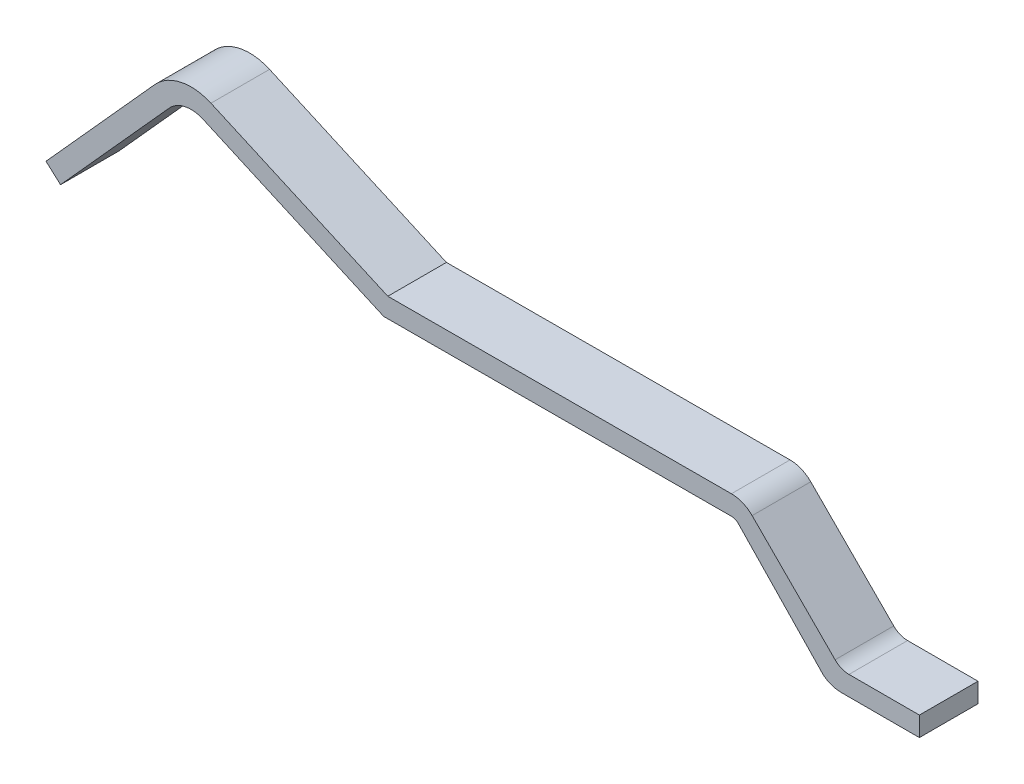
ISO-10303-21;
HEADER;
FILE_DESCRIPTION(('STEP AP214'),'2;1');
FILE_NAME('part.step','',(''),(''),'','','');
FILE_SCHEMA(('AUTOMOTIVE_DESIGN { 1 0 10303 214 1 1 1 1 }'));
ENDSEC;
DATA;
#1=APPLICATION_CONTEXT('core data for automotive mechanical design processes');
#2=APPLICATION_PROTOCOL_DEFINITION('international standard','automotive_design',2000,#1);
#3=PRODUCT_CONTEXT('',#1,'mechanical');
#4=PRODUCT('Part','Part','',(#3));
#5=PRODUCT_RELATED_PRODUCT_CATEGORY('part','',(#4));
#6=PRODUCT_DEFINITION_FORMATION('','',#4);
#7=PRODUCT_DEFINITION_CONTEXT('part definition',#1,'design');
#8=PRODUCT_DEFINITION('design','',#6,#7);
#9=PRODUCT_DEFINITION_SHAPE('','',#8);
#10=(LENGTH_UNIT() NAMED_UNIT(*) SI_UNIT(.MILLI.,.METRE.));
#11=(NAMED_UNIT(*) PLANE_ANGLE_UNIT() SI_UNIT($,.RADIAN.));
#12=(NAMED_UNIT(*) SI_UNIT($,.STERADIAN.) SOLID_ANGLE_UNIT());
#13=UNCERTAINTY_MEASURE_WITH_UNIT(LENGTH_MEASURE(1.E-05),#10,'distance_accuracy_value','');
#14=(GEOMETRIC_REPRESENTATION_CONTEXT(3) GLOBAL_UNCERTAINTY_ASSIGNED_CONTEXT((#13)) GLOBAL_UNIT_ASSIGNED_CONTEXT((#10,
#11,#12)) REPRESENTATION_CONTEXT('',''));
#15=CARTESIAN_POINT('',(0.,0.,0.));
#16=DIRECTION('',(0.,0.,1.));
#17=DIRECTION('',(1.,0.,0.));
#18=AXIS2_PLACEMENT_3D('',#15,#16,#17);
#19=CARTESIAN_POINT('',(17.1707476581065,0.197947805161229,0.3));
#20=DIRECTION('',(0.,-1.,0.));
#21=DIRECTION('',(1.,0.,0.));
#22=AXIS2_PLACEMENT_3D('',#19,#20,#21);
#23=PLANE('',#22);
#24=DIRECTION('',(-1.,0.,0.));
#25=VECTOR('',#24,1.);
#26=CARTESIAN_POINT('',(17.1707476581065,0.197947805161229,-0.3));
#27=LINE('',#26,#25);
#28=CARTESIAN_POINT('',(17.8917527563786,0.197947805161229,-0.3));
#29=VERTEX_POINT('',#28);
#30=CARTESIAN_POINT('',(17.1707476581065,0.197947805161225,-0.3));
#31=VERTEX_POINT('',#30);
#32=EDGE_CURVE('E188',#29,#31,#27,.T.);
#33=ORIENTED_EDGE('',*,*,#32,.T.);
#34=DIRECTION('',(0.,0.,-1.));
#35=VECTOR('',#34,1.);
#36=CARTESIAN_POINT('',(17.1707476581065,0.197947805161225,0.3));
#37=LINE('',#36,#35);
#38=CARTESIAN_POINT('',(17.1707476581065,0.197947805161225,0.3));
#39=VERTEX_POINT('',#38);
#40=EDGE_CURVE('E11',#39,#31,#37,.T.);
#41=ORIENTED_EDGE('',*,*,#40,.F.);
#42=DIRECTION('',(-1.,0.,0.));
#43=VECTOR('',#42,1.);
#44=CARTESIAN_POINT('',(17.1707476581065,0.197947805161229,0.3));
#45=LINE('',#44,#43);
#46=CARTESIAN_POINT('',(17.8917527563786,0.197947805161229,0.3));
#47=VERTEX_POINT('',#46);
#48=EDGE_CURVE('E222',#47,#39,#45,.T.);
#49=ORIENTED_EDGE('',*,*,#48,.F.);
#50=DIRECTION('',(0.,0.,-1.));
#51=VECTOR('',#50,1.);
#52=CARTESIAN_POINT('',(17.8917527563786,0.197947805161229,0.3));
#53=LINE('',#52,#51);
#54=EDGE_CURVE('E184',#47,#29,#53,.T.);
#55=ORIENTED_EDGE('',*,*,#54,.T.);
#56=EDGE_LOOP('',(#33,#41,#49,#55));
#57=FACE_BOUND('',#56,.T.);
#58=ADVANCED_FACE('F32',(#57),#23,.F.);
#59=CARTESIAN_POINT('',(17.1707476581065,0.397947805161221,0.3));
#60=DIRECTION('',(0.,0.,-1.));
#61=DIRECTION('',(-1.,0.,0.));
#62=AXIS2_PLACEMENT_3D('',#59,#60,#61);
#63=CYLINDRICAL_SURFACE('',#62,0.199999999999996);
#64=CARTESIAN_POINT('',(17.1707476581065,0.397947805161221,-0.3));
#65=DIRECTION('',(0.,0.,-1.));
#66=DIRECTION('',(1.,0.,0.));
#67=AXIS2_PLACEMENT_3D('',#64,#65,#66);
#68=CIRCLE('',#67,0.199999999999996);
#69=CARTESIAN_POINT('',(17.0290071205478,0.256846352253875,-0.3));
#70=VERTEX_POINT('',#69);
#71=EDGE_CURVE('E191',#31,#70,#68,.T.);
#72=ORIENTED_EDGE('',*,*,#71,.T.);
#73=DIRECTION('',(0.,0.,-1.));
#74=VECTOR('',#73,1.);
#75=CARTESIAN_POINT('',(17.0290071205478,0.256846352253875,0.3));
#76=LINE('',#75,#74);
#77=CARTESIAN_POINT('',(17.0290071205478,0.256846352253875,0.3));
#78=VERTEX_POINT('',#77);
#79=EDGE_CURVE('E40',#78,#70,#76,.T.);
#80=ORIENTED_EDGE('',*,*,#79,.F.);
#81=CARTESIAN_POINT('',(17.1707476581065,0.397947805161221,0.3));
#82=DIRECTION('',(0.,0.,-1.));
#83=DIRECTION('',(1.,0.,0.));
#84=AXIS2_PLACEMENT_3D('',#81,#82,#83);
#85=CIRCLE('',#84,0.199999999999996);
#86=EDGE_CURVE('E121',#39,#78,#85,.T.);
#87=ORIENTED_EDGE('',*,*,#86,.F.);
#88=ORIENTED_EDGE('',*,*,#40,.T.);
#89=EDGE_LOOP('',(#72,#80,#87,#88));
#90=FACE_BOUND('',#89,.T.);
#91=ADVANCED_FACE('F330',(#90),#63,.F.);
#92=CARTESIAN_POINT('',(16.1796207220227,1.11007983951695,0.3));
#93=DIRECTION('',(-0.708702687793621,-0.705507264536728,0.));
#94=DIRECTION('',(0.705507264536728,-0.708702687793621,0.));
#95=AXIS2_PLACEMENT_3D('',#92,#93,#94);
#96=PLANE('',#95);
#97=DIRECTION('',(-0.705507264536728,0.708702687793621,0.));
#98=VECTOR('',#97,1.);
#99=CARTESIAN_POINT('',(16.1796207220227,1.11007983951695,-0.3));
#100=LINE('',#99,#98);
#101=CARTESIAN_POINT('',(16.1796207220227,1.11007983951695,-0.3));
#102=VERTEX_POINT('',#101);
#103=EDGE_CURVE('E193',#70,#102,#100,.T.);
#104=ORIENTED_EDGE('',*,*,#103,.T.);
#105=DIRECTION('',(0.,0.,-1.));
#106=VECTOR('',#105,1.);
#107=CARTESIAN_POINT('',(16.1796207220227,1.11007983951695,0.3));
#108=LINE('',#107,#106);
#109=CARTESIAN_POINT('',(16.1796207220227,1.11007983951695,0.3));
#110=VERTEX_POINT('',#109);
#111=EDGE_CURVE('E259',#110,#102,#108,.T.);
#112=ORIENTED_EDGE('',*,*,#111,.F.);
#113=DIRECTION('',(-0.705507264536728,0.708702687793621,0.));
#114=VECTOR('',#113,1.);
#115=CARTESIAN_POINT('',(16.1796207220227,1.11007983951695,0.3));
#116=LINE('',#115,#114);
#117=EDGE_CURVE('E267',#78,#110,#116,.T.);
#118=ORIENTED_EDGE('',*,*,#117,.F.);
#119=ORIENTED_EDGE('',*,*,#79,.T.);
#120=EDGE_LOOP('',(#104,#112,#118,#119));
#121=FACE_BOUND('',#120,.T.);
#122=ADVANCED_FACE('F265',(#121),#96,.F.);
#123=CARTESIAN_POINT('',(15.968162863443,0.899575409463471,0.3));
#124=DIRECTION('',(0.,0.,-1.));
#125=DIRECTION('',(-1.,0.,0.));
#126=AXIS2_PLACEMENT_3D('',#123,#124,#125);
#127=CYLINDRICAL_SURFACE('',#126,0.29837315735042);
#128=CARTESIAN_POINT('',(15.968162863443,0.899575409463471,-0.3));
#129=DIRECTION('',(0.,0.,1.));
#130=DIRECTION('',(1.,0.,0.));
#131=AXIS2_PLACEMENT_3D('',#128,#129,#130);
#132=CIRCLE('',#131,0.29837315735042);
#133=CARTESIAN_POINT('',(15.9674886876667,1.197947805161,-0.3));
#134=VERTEX_POINT('',#133);
#135=EDGE_CURVE('E195',#102,#134,#132,.T.);
#136=ORIENTED_EDGE('',*,*,#135,.T.);
#137=DIRECTION('',(0.,0.,-1.));
#138=VECTOR('',#137,1.);
#139=CARTESIAN_POINT('',(15.9674886876667,1.197947805161,0.3));
#140=LINE('',#139,#138);
#141=CARTESIAN_POINT('',(15.9674886876667,1.197947805161,0.3));
#142=VERTEX_POINT('',#141);
#143=EDGE_CURVE('E256',#142,#134,#140,.T.);
#144=ORIENTED_EDGE('',*,*,#143,.F.);
#145=CARTESIAN_POINT('',(15.968162863443,0.899575409463471,0.3));
#146=DIRECTION('',(0.,0.,1.));
#147=DIRECTION('',(1.,0.,0.));
#148=AXIS2_PLACEMENT_3D('',#145,#146,#147);
#149=CIRCLE('',#148,0.29837315735042);
#150=EDGE_CURVE('E285',#110,#142,#149,.T.);
#151=ORIENTED_EDGE('',*,*,#150,.F.);
#152=ORIENTED_EDGE('',*,*,#111,.T.);
#153=EDGE_LOOP('',(#136,#144,#151,#152));
#154=FACE_BOUND('',#153,.T.);
#155=ADVANCED_FACE('F276',(#154),#127,.T.);
#156=CARTESIAN_POINT('',(12.45,1.19000000000001,0.3));
#157=DIRECTION('',(0.00225950545359394,-0.999997447314294,0.));
#158=DIRECTION('',(0.999997447314295,0.00225950545359394,0.));
#159=AXIS2_PLACEMENT_3D('',#156,#157,#158);
#160=PLANE('',#159);
#161=DIRECTION('',(-0.999997447314295,-0.00225950545359394,0.));
#162=VECTOR('',#161,1.);
#163=CARTESIAN_POINT('',(12.45,1.19000000000001,-0.3));
#164=LINE('',#163,#162);
#165=CARTESIAN_POINT('',(12.45,1.19000000000001,-0.3));
#166=VERTEX_POINT('',#165);
#167=EDGE_CURVE('E197',#134,#166,#164,.T.);
#168=ORIENTED_EDGE('',*,*,#167,.T.);
#169=DIRECTION('',(0.,0.,-1.));
#170=VECTOR('',#169,1.);
#171=CARTESIAN_POINT('',(12.45,1.19000000000001,0.3));
#172=LINE('',#171,#170);
#173=CARTESIAN_POINT('',(12.45,1.19000000000001,0.3));
#174=VERTEX_POINT('',#173);
#175=EDGE_CURVE('E253',#174,#166,#172,.T.);
#176=ORIENTED_EDGE('',*,*,#175,.F.);
#177=DIRECTION('',(-0.999997447314295,-0.00225950545359394,0.));
#178=VECTOR('',#177,1.);
#179=CARTESIAN_POINT('',(12.45,1.19000000000001,0.3));
#180=LINE('',#179,#178);
#181=EDGE_CURVE('E282',#142,#174,#180,.T.);
#182=ORIENTED_EDGE('',*,*,#181,.F.);
#183=ORIENTED_EDGE('',*,*,#143,.T.);
#184=EDGE_LOOP('',(#168,#176,#182,#183));
#185=FACE_BOUND('',#184,.T.);
#186=ADVANCED_FACE('F280',(#185),#160,.F.);
#187=CARTESIAN_POINT('',(10.6393188810586,1.9961671740989,0.3));
#188=DIRECTION('',(-0.40673664307565,-0.913545457642667,0.));
#189=DIRECTION('',(0.913545457642668,-0.40673664307565,0.));
#190=AXIS2_PLACEMENT_3D('',#187,#188,#189);
#191=PLANE('',#190);
#192=DIRECTION('',(-0.913545457642668,0.40673664307565,0.));
#193=VECTOR('',#192,1.);
#194=CARTESIAN_POINT('',(10.6393188810586,1.9961671740989,-0.3));
#195=LINE('',#194,#193);
#196=CARTESIAN_POINT('',(10.6393188810586,1.9961671740989,-0.3));
#197=VERTEX_POINT('',#196);
#198=EDGE_CURVE('E199',#166,#197,#195,.T.);
#199=ORIENTED_EDGE('',*,*,#198,.T.);
#200=DIRECTION('',(0.,0.,-1.));
#201=VECTOR('',#200,1.);
#202=CARTESIAN_POINT('',(10.6393188810586,1.9961671740989,0.3));
#203=LINE('',#202,#201);
#204=CARTESIAN_POINT('',(10.6393188810586,1.9961671740989,0.3));
#205=VERTEX_POINT('',#204);
#206=EDGE_CURVE('E250',#205,#197,#203,.T.);
#207=ORIENTED_EDGE('',*,*,#206,.F.);
#208=DIRECTION('',(-0.913545457642668,0.40673664307565,0.));
#209=VECTOR('',#208,1.);
#210=CARTESIAN_POINT('',(10.6393188810586,1.9961671740989,0.3));
#211=LINE('',#210,#209);
#212=EDGE_CURVE('E284',#174,#205,#211,.T.);
#213=ORIENTED_EDGE('',*,*,#212,.F.);
#214=ORIENTED_EDGE('',*,*,#175,.T.);
#215=EDGE_LOOP('',(#199,#207,#213,#214));
#216=FACE_BOUND('',#215,.T.);
#217=ADVANCED_FACE('F343',(#216),#191,.F.);
#218=CARTESIAN_POINT('',(10.4359505595208,1.53939444527736,0.3));
#219=DIRECTION('',(0.,0.,-1.));
#220=DIRECTION('',(-1.,0.,0.));
#221=AXIS2_PLACEMENT_3D('',#218,#219,#220);
#222=CYLINDRICAL_SURFACE('',#221,0.50000000000019);
#223=CARTESIAN_POINT('',(10.4359505595208,1.53939444527736,-0.3));
#224=DIRECTION('',(0.,0.,1.));
#225=DIRECTION('',(1.,0.,0.));
#226=AXIS2_PLACEMENT_3D('',#223,#224,#225);
#227=CIRCLE('',#226,0.50000000000019);
#228=CARTESIAN_POINT('',(10.0643781467819,1.87395974845692,-0.3));
#229=VERTEX_POINT('',#228);
#230=EDGE_CURVE('E201',#197,#229,#227,.T.);
#231=ORIENTED_EDGE('',*,*,#230,.T.);
#232=DIRECTION('',(0.,0.,-1.));
#233=VECTOR('',#232,1.);
#234=CARTESIAN_POINT('',(10.0643781467819,1.87395974845692,0.3));
#235=LINE('',#234,#233);
#236=CARTESIAN_POINT('',(10.0643781467819,1.87395974845692,0.3));
#237=VERTEX_POINT('',#236);
#238=EDGE_CURVE('E247',#237,#229,#235,.T.);
#239=ORIENTED_EDGE('',*,*,#238,.F.);
#240=CARTESIAN_POINT('',(10.4359505595208,1.53939444527736,0.3));
#241=DIRECTION('',(0.,0.,1.));
#242=DIRECTION('',(1.,0.,0.));
#243=AXIS2_PLACEMENT_3D('',#240,#241,#242);
#244=CIRCLE('',#243,0.50000000000019);
#245=EDGE_CURVE('E287',#205,#237,#244,.T.);
#246=ORIENTED_EDGE('',*,*,#245,.F.);
#247=ORIENTED_EDGE('',*,*,#206,.T.);
#248=EDGE_LOOP('',(#231,#239,#246,#247));
#249=FACE_BOUND('',#248,.T.);
#250=ADVANCED_FACE('F346',(#249),#222,.T.);
#251=CARTESIAN_POINT('',(8.95090286046869,0.63732016052452,0.3));
#252=DIRECTION('',(0.743144825477361,-0.669130606358895,0.));
#253=DIRECTION('',(0.669130606358895,0.743144825477361,0.));
#254=AXIS2_PLACEMENT_3D('',#251,#252,#253);
#255=PLANE('',#254);
#256=DIRECTION('',(-0.669130606358895,-0.743144825477361,0.));
#257=VECTOR('',#256,1.);
#258=CARTESIAN_POINT('',(8.95090286046869,0.63732016052452,-0.3));
#259=LINE('',#258,#257);
#260=CARTESIAN_POINT('',(8.95090286046869,0.63732016052452,-0.3));
#261=VERTEX_POINT('',#260);
#262=EDGE_CURVE('E203',#229,#261,#259,.T.);
#263=ORIENTED_EDGE('',*,*,#262,.T.);
#264=DIRECTION('',(0.,0.,-1.));
#265=VECTOR('',#264,1.);
#266=CARTESIAN_POINT('',(8.95090286046869,0.63732016052452,0.3));
#267=LINE('',#266,#265);
#268=CARTESIAN_POINT('',(8.95090286046869,0.63732016052452,0.3));
#269=VERTEX_POINT('',#268);
#270=EDGE_CURVE('E244',#269,#261,#267,.T.);
#271=ORIENTED_EDGE('',*,*,#270,.F.);
#272=DIRECTION('',(-0.669130606358895,-0.743144825477361,0.));
#273=VECTOR('',#272,1.);
#274=CARTESIAN_POINT('',(8.95090286046869,0.63732016052452,0.3));
#275=LINE('',#274,#273);
#276=EDGE_CURVE('E293',#237,#269,#275,.T.);
#277=ORIENTED_EDGE('',*,*,#276,.F.);
#278=ORIENTED_EDGE('',*,*,#238,.T.);
#279=EDGE_LOOP('',(#263,#271,#277,#278));
#280=FACE_BOUND('',#279,.T.);
#281=ADVANCED_FACE('F350',(#280),#255,.F.);
#282=CARTESIAN_POINT('',(9.09953182556442,0.503494039252559,0.3));
#283=DIRECTION('',(0.669130606358746,0.743144825477495,0.));
#284=DIRECTION('',(-0.743144825477495,0.669130606358746,0.));
#285=AXIS2_PLACEMENT_3D('',#282,#283,#284);
#286=PLANE('',#285);
#287=DIRECTION('',(0.743144825477495,-0.669130606358746,0.));
#288=VECTOR('',#287,1.);
#289=CARTESIAN_POINT('',(9.09953182556442,0.503494039252559,-0.3));
#290=LINE('',#289,#288);
#291=CARTESIAN_POINT('',(9.09953182556442,0.503494039252559,-0.3));
#292=VERTEX_POINT('',#291);
#293=EDGE_CURVE('E205',#261,#292,#290,.T.);
#294=ORIENTED_EDGE('',*,*,#293,.T.);
#295=DIRECTION('',(0.,0.,-1.));
#296=VECTOR('',#295,1.);
#297=CARTESIAN_POINT('',(9.09953182556442,0.503494039252559,0.3));
#298=LINE('',#297,#296);
#299=CARTESIAN_POINT('',(9.09953182556442,0.503494039252559,0.3));
#300=VERTEX_POINT('',#299);
#301=EDGE_CURVE('E241',#300,#292,#298,.T.);
#302=ORIENTED_EDGE('',*,*,#301,.F.);
#303=DIRECTION('',(0.743144825477495,-0.669130606358746,0.));
#304=VECTOR('',#303,1.);
#305=CARTESIAN_POINT('',(9.09953182556442,0.503494039252559,0.3));
#306=LINE('',#305,#304);
#307=EDGE_CURVE('E295',#269,#300,#306,.T.);
#308=ORIENTED_EDGE('',*,*,#307,.F.);
#309=ORIENTED_EDGE('',*,*,#270,.T.);
#310=EDGE_LOOP('',(#294,#302,#308,#309));
#311=FACE_BOUND('',#310,.T.);
#312=ADVANCED_FACE('F354',(#311),#286,.F.);
#313=CARTESIAN_POINT('',(10.2130071118774,1.74013362718514,0.3));
#314=DIRECTION('',(-0.743144825477495,0.669130606358746,0.));
#315=DIRECTION('',(-0.669130606358746,-0.743144825477495,0.));
#316=AXIS2_PLACEMENT_3D('',#313,#314,#315);
#317=PLANE('',#316);
#318=DIRECTION('',(0.669130606358746,0.743144825477495,0.));
#319=VECTOR('',#318,1.);
#320=CARTESIAN_POINT('',(10.2130071118774,1.74013362718514,-0.3));
#321=LINE('',#320,#319);
#322=CARTESIAN_POINT('',(10.2130071118774,1.74013362718514,-0.3));
#323=VERTEX_POINT('',#322);
#324=EDGE_CURVE('E207',#292,#323,#321,.T.);
#325=ORIENTED_EDGE('',*,*,#324,.T.);
#326=DIRECTION('',(0.,0.,-1.));
#327=VECTOR('',#326,1.);
#328=CARTESIAN_POINT('',(10.2130071118774,1.74013362718514,0.3));
#329=LINE('',#328,#327);
#330=CARTESIAN_POINT('',(10.2130071118774,1.74013362718514,0.3));
#331=VERTEX_POINT('',#330);
#332=EDGE_CURVE('E238',#331,#323,#329,.T.);
#333=ORIENTED_EDGE('',*,*,#332,.F.);
#334=DIRECTION('',(0.669130606358746,0.743144825477495,0.));
#335=VECTOR('',#334,1.);
#336=CARTESIAN_POINT('',(10.2130071118774,1.74013362718514,0.3));
#337=LINE('',#336,#335);
#338=EDGE_CURVE('E297',#300,#331,#337,.T.);
#339=ORIENTED_EDGE('',*,*,#338,.F.);
#340=ORIENTED_EDGE('',*,*,#301,.T.);
#341=EDGE_LOOP('',(#325,#333,#339,#340));
#342=FACE_BOUND('',#341,.T.);
#343=ADVANCED_FACE('F358',(#342),#317,.F.);
#344=CARTESIAN_POINT('',(10.4359505595208,1.53939444527741,0.3));
#345=DIRECTION('',(0.,0.,-1.));
#346=DIRECTION('',(-1.,0.,0.));
#347=AXIS2_PLACEMENT_3D('',#344,#345,#346);
#348=CYLINDRICAL_SURFACE('',#347,0.300000000000162);
#349=CARTESIAN_POINT('',(10.4359505595208,1.53939444527741,-0.3));
#350=DIRECTION('',(0.,0.,-1.));
#351=DIRECTION('',(1.,0.,0.));
#352=AXIS2_PLACEMENT_3D('',#349,#350,#351);
#353=CIRCLE('',#352,0.300000000000162);
#354=CARTESIAN_POINT('',(10.5579715524435,1.81345808257036,-0.3));
#355=VERTEX_POINT('',#354);
#356=EDGE_CURVE('E209',#323,#355,#353,.T.);
#357=ORIENTED_EDGE('',*,*,#356,.T.);
#358=DIRECTION('',(0.,0.,-1.));
#359=VECTOR('',#358,1.);
#360=CARTESIAN_POINT('',(10.5579715524435,1.81345808257036,0.3));
#361=LINE('',#360,#359);
#362=CARTESIAN_POINT('',(10.5579715524435,1.81345808257036,0.3));
#363=VERTEX_POINT('',#362);
#364=EDGE_CURVE('E235',#363,#355,#361,.T.);
#365=ORIENTED_EDGE('',*,*,#364,.F.);
#366=CARTESIAN_POINT('',(10.4359505595208,1.53939444527741,0.3));
#367=DIRECTION('',(0.,0.,-1.));
#368=DIRECTION('',(1.,0.,0.));
#369=AXIS2_PLACEMENT_3D('',#366,#367,#368);
#370=CIRCLE('',#369,0.300000000000162);
#371=EDGE_CURVE('E299',#331,#363,#370,.T.);
#372=ORIENTED_EDGE('',*,*,#371,.F.);
#373=ORIENTED_EDGE('',*,*,#332,.T.);
#374=EDGE_LOOP('',(#357,#365,#372,#373));
#375=FACE_BOUND('',#374,.T.);
#376=ADVANCED_FACE('F362',(#375),#348,.F.);
#377=CARTESIAN_POINT('',(12.407488687666,0.99,0.3));
#378=DIRECTION('',(0.40673664307565,0.913545457642667,0.));
#379=DIRECTION('',(-0.913545457642668,0.40673664307565,0.));
#380=AXIS2_PLACEMENT_3D('',#377,#378,#379);
#381=PLANE('',#380);
#382=DIRECTION('',(0.913545457642668,-0.40673664307565,0.));
#383=VECTOR('',#382,1.);
#384=CARTESIAN_POINT('',(12.407488687666,0.99,-0.3));
#385=LINE('',#384,#383);
#386=CARTESIAN_POINT('',(12.407488687666,0.99,-0.3));
#387=VERTEX_POINT('',#386);
#388=EDGE_CURVE('E211',#355,#387,#385,.T.);
#389=ORIENTED_EDGE('',*,*,#388,.T.);
#390=DIRECTION('',(0.,0.,-1.));
#391=VECTOR('',#390,1.);
#392=CARTESIAN_POINT('',(12.407488687666,0.99,0.3));
#393=LINE('',#392,#391);
#394=CARTESIAN_POINT('',(12.407488687666,0.99,0.3));
#395=VERTEX_POINT('',#394);
#396=EDGE_CURVE('E232',#395,#387,#393,.T.);
#397=ORIENTED_EDGE('',*,*,#396,.F.);
#398=DIRECTION('',(0.913545457642668,-0.40673664307565,0.));
#399=VECTOR('',#398,1.);
#400=CARTESIAN_POINT('',(12.407488687666,0.99,0.3));
#401=LINE('',#400,#399);
#402=EDGE_CURVE('E301',#363,#395,#401,.T.);
#403=ORIENTED_EDGE('',*,*,#402,.F.);
#404=ORIENTED_EDGE('',*,*,#364,.T.);
#405=EDGE_LOOP('',(#389,#397,#403,#404));
#406=FACE_BOUND('',#405,.T.);
#407=ADVANCED_FACE('F366',(#406),#381,.F.);
#408=CARTESIAN_POINT('',(15.967488687666,0.998043859948213,0.3));
#409=DIRECTION('',(-0.00225950545358628,0.999997447314294,0.));
#410=DIRECTION('',(-0.999997447314295,-0.00225950545358628,0.));
#411=AXIS2_PLACEMENT_3D('',#408,#409,#410);
#412=PLANE('',#411);
#413=DIRECTION('',(0.999997447314295,0.00225950545358628,0.));
#414=VECTOR('',#413,1.);
#415=CARTESIAN_POINT('',(15.967488687666,0.998043859948213,-0.3));
#416=LINE('',#415,#414);
#417=CARTESIAN_POINT('',(15.967488687666,0.998043859948221,-0.3));
#418=VERTEX_POINT('',#417);
#419=EDGE_CURVE('E213',#387,#418,#416,.T.);
#420=ORIENTED_EDGE('',*,*,#419,.T.);
#421=DIRECTION('',(0.,0.,-1.));
#422=VECTOR('',#421,1.);
#423=CARTESIAN_POINT('',(15.967488687666,0.998043859948221,0.3));
#424=LINE('',#423,#422);
#425=CARTESIAN_POINT('',(15.967488687666,0.998043859948221,0.3));
#426=VERTEX_POINT('',#425);
#427=EDGE_CURVE('E229',#426,#418,#424,.T.);
#428=ORIENTED_EDGE('',*,*,#427,.F.);
#429=DIRECTION('',(0.999997447314295,0.00225950545358628,0.));
#430=VECTOR('',#429,1.);
#431=CARTESIAN_POINT('',(15.967488687666,0.998043859948213,0.3));
#432=LINE('',#431,#430);
#433=EDGE_CURVE('E303',#395,#426,#432,.T.);
#434=ORIENTED_EDGE('',*,*,#433,.F.);
#435=ORIENTED_EDGE('',*,*,#396,.T.);
#436=EDGE_LOOP('',(#420,#428,#434,#435));
#437=FACE_BOUND('',#436,.T.);
#438=ADVANCED_FACE('F370',(#437),#412,.F.);
#439=CARTESIAN_POINT('',(15.9677134245142,0.898581265536285,0.3));
#440=DIRECTION('',(0.,0.,-1.));
#441=DIRECTION('',(-1.,0.,0.));
#442=AXIS2_PLACEMENT_3D('',#439,#440,#441);
#443=CYLINDRICAL_SURFACE('',#442,0.0994628483093272);
#444=CARTESIAN_POINT('',(15.9677134245142,0.898581265536285,-0.3));
#445=DIRECTION('',(0.,0.,-1.));
#446=DIRECTION('',(-1.,0.,0.));
#447=AXIS2_PLACEMENT_3D('',#444,#445,#446);
#448=CIRCLE('',#447,0.0994628483093272);
#449=CARTESIAN_POINT('',(16.0381993657854,0.968756690557605,-0.3));
#450=VERTEX_POINT('',#449);
#451=EDGE_CURVE('E215',#418,#450,#448,.T.);
#452=ORIENTED_EDGE('',*,*,#451,.T.);
#453=DIRECTION('',(0.,0.,-1.));
#454=VECTOR('',#453,1.);
#455=CARTESIAN_POINT('',(16.0381993657854,0.968756690557605,0.3));
#456=LINE('',#455,#454);
#457=CARTESIAN_POINT('',(16.0381993657854,0.968756690557605,0.3));
#458=VERTEX_POINT('',#457);
#459=EDGE_CURVE('E226',#458,#450,#456,.T.);
#460=ORIENTED_EDGE('',*,*,#459,.F.);
#461=CARTESIAN_POINT('',(15.9677134245142,0.898581265536285,0.3));
#462=DIRECTION('',(0.,0.,-1.));
#463=DIRECTION('',(-1.,0.,0.));
#464=AXIS2_PLACEMENT_3D('',#461,#462,#463);
#465=CIRCLE('',#464,0.0994628483093272);
#466=EDGE_CURVE('E305',#426,#458,#465,.T.);
#467=ORIENTED_EDGE('',*,*,#466,.F.);
#468=ORIENTED_EDGE('',*,*,#427,.T.);
#469=EDGE_LOOP('',(#452,#460,#467,#468));
#470=FACE_BOUND('',#469,.T.);
#471=ADVANCED_FACE('F311',(#470),#443,.F.);
#472=CARTESIAN_POINT('',(16.9117527563786,0.0579478051610878,0.3));
#473=DIRECTION('',(0.72171309209664,0.692192323488427,0.));
#474=DIRECTION('',(-0.692192323488427,0.72171309209664,0.));
#475=AXIS2_PLACEMENT_3D('',#472,#473,#474);
#476=PLANE('',#475);
#477=DIRECTION('',(0.692192323488427,-0.72171309209664,0.));
#478=VECTOR('',#477,1.);
#479=CARTESIAN_POINT('',(16.9117527563786,0.0579478051610878,-0.3));
#480=LINE('',#479,#478);
#481=CARTESIAN_POINT('',(16.9117527563786,0.0579478051610877,-0.3));
#482=VERTEX_POINT('',#481);
#483=EDGE_CURVE('E217',#450,#482,#480,.T.);
#484=ORIENTED_EDGE('',*,*,#483,.T.);
#485=DIRECTION('',(0.,0.,-1.));
#486=VECTOR('',#485,1.);
#487=CARTESIAN_POINT('',(16.9117527563786,0.0579478051610877,0.3));
#488=LINE('',#487,#486);
#489=CARTESIAN_POINT('',(16.9117527563786,0.0579478051610877,0.3));
#490=VERTEX_POINT('',#489);
#491=EDGE_CURVE('E179',#490,#482,#488,.T.);
#492=ORIENTED_EDGE('',*,*,#491,.F.);
#493=DIRECTION('',(0.692192323488427,-0.72171309209664,0.));
#494=VECTOR('',#493,1.);
#495=CARTESIAN_POINT('',(16.9117527563786,0.0579478051610878,0.3));
#496=LINE('',#495,#494);
#497=EDGE_CURVE('E170',#458,#490,#496,.T.);
#498=ORIENTED_EDGE('',*,*,#497,.F.);
#499=ORIENTED_EDGE('',*,*,#459,.T.);
#500=EDGE_LOOP('',(#484,#492,#498,#499));
#501=FACE_BOUND('',#500,.T.);
#502=ADVANCED_FACE('F315',(#501),#476,.F.);
#503=CARTESIAN_POINT('',(17.0917527563786,0.297947805161533,0.3));
#504=DIRECTION('',(0.,0.,-1.));
#505=DIRECTION('',(-1.,0.,0.));
#506=AXIS2_PLACEMENT_3D('',#503,#504,#505);
#507=CYLINDRICAL_SURFACE('',#506,0.300000000000358);
#508=CARTESIAN_POINT('',(17.0917527563786,0.297947805161533,-0.3));
#509=DIRECTION('',(0.,0.,1.));
#510=DIRECTION('',(-1.,0.,0.));
#511=AXIS2_PLACEMENT_3D('',#508,#509,#510);
#512=CIRCLE('',#511,0.300000000000358);
#513=CARTESIAN_POINT('',(17.0917527563786,-0.00205219483882501,-0.3));
#514=VERTEX_POINT('',#513);
#515=EDGE_CURVE('E178',#482,#514,#512,.T.);
#516=ORIENTED_EDGE('',*,*,#515,.T.);
#517=DIRECTION('',(0.,0.,-1.));
#518=VECTOR('',#517,1.);
#519=CARTESIAN_POINT('',(17.0917527563786,-0.00205219483882501,0.3));
#520=LINE('',#519,#518);
#521=CARTESIAN_POINT('',(17.0917527563786,-0.00205219483882501,0.3));
#522=VERTEX_POINT('',#521);
#523=EDGE_CURVE('E175',#522,#514,#520,.T.);
#524=ORIENTED_EDGE('',*,*,#523,.F.);
#525=CARTESIAN_POINT('',(17.0917527563786,0.297947805161533,0.3));
#526=DIRECTION('',(0.,0.,1.));
#527=DIRECTION('',(-1.,0.,0.));
#528=AXIS2_PLACEMENT_3D('',#525,#526,#527);
#529=CIRCLE('',#528,0.300000000000358);
#530=EDGE_CURVE('E164',#490,#522,#529,.T.);
#531=ORIENTED_EDGE('',*,*,#530,.F.);
#532=ORIENTED_EDGE('',*,*,#491,.T.);
#533=EDGE_LOOP('',(#516,#524,#531,#532));
#534=FACE_BOUND('',#533,.T.);
#535=ADVANCED_FACE('F176',(#534),#507,.T.);
#536=CARTESIAN_POINT('',(17.8917527563786,-0.00205219483882491,0.3));
#537=DIRECTION('',(0.,1.,0.));
#538=DIRECTION('',(-1.,0.,0.));
#539=AXIS2_PLACEMENT_3D('',#536,#537,#538);
#540=PLANE('',#539);
#541=DIRECTION('',(1.,0.,0.));
#542=VECTOR('',#541,1.);
#543=CARTESIAN_POINT('',(17.8917527563786,-0.00205219483882491,-0.3));
#544=LINE('',#543,#542);
#545=CARTESIAN_POINT('',(17.8917527563786,-0.00205219483882491,-0.3));
#546=VERTEX_POINT('',#545);
#547=EDGE_CURVE('E107',#514,#546,#544,.T.);
#548=ORIENTED_EDGE('',*,*,#547,.T.);
#549=DIRECTION('',(0.,0.,-1.));
#550=VECTOR('',#549,1.);
#551=CARTESIAN_POINT('',(17.8917527563786,-0.00205219483882491,0.3));
#552=LINE('',#551,#550);
#553=CARTESIAN_POINT('',(17.8917527563786,-0.00205219483882491,0.3));
#554=VERTEX_POINT('',#553);
#555=EDGE_CURVE('E180',#554,#546,#552,.T.);
#556=ORIENTED_EDGE('',*,*,#555,.F.);
#557=DIRECTION('',(1.,0.,0.));
#558=VECTOR('',#557,1.);
#559=CARTESIAN_POINT('',(17.8917527563786,-0.00205219483882491,0.3));
#560=LINE('',#559,#558);
#561=EDGE_CURVE('E168',#522,#554,#560,.T.);
#562=ORIENTED_EDGE('',*,*,#561,.F.);
#563=ORIENTED_EDGE('',*,*,#523,.T.);
#564=EDGE_LOOP('',(#548,#556,#562,#563));
#565=FACE_BOUND('',#564,.T.);
#566=ADVANCED_FACE('F182',(#565),#540,.F.);
#567=CARTESIAN_POINT('',(17.8917527563786,0.197947805161229,0.3));
#568=DIRECTION('',(-1.,0.,0.));
#569=DIRECTION('',(0.,0.,1.));
#570=AXIS2_PLACEMENT_3D('',#567,#568,#569);
#571=PLANE('',#570);
#572=DIRECTION('',(0.,1.,0.));
#573=VECTOR('',#572,1.);
#574=CARTESIAN_POINT('',(17.8917527563786,0.197947805161229,-0.3));
#575=LINE('',#574,#573);
#576=EDGE_CURVE('E113',#546,#29,#575,.T.);
#577=ORIENTED_EDGE('',*,*,#576,.T.);
#578=ORIENTED_EDGE('',*,*,#54,.F.);
#579=DIRECTION('',(0.,1.,0.));
#580=VECTOR('',#579,1.);
#581=CARTESIAN_POINT('',(17.8917527563786,0.197947805161229,0.3));
#582=LINE('',#581,#580);
#583=EDGE_CURVE('E48',#554,#47,#582,.T.);
#584=ORIENTED_EDGE('',*,*,#583,.F.);
#585=ORIENTED_EDGE('',*,*,#555,.T.);
#586=EDGE_LOOP('',(#577,#578,#584,#585));
#587=FACE_BOUND('',#586,.T.);
#588=ADVANCED_FACE('F319',(#587),#571,.F.);
#589=CARTESIAN_POINT('',(17.0917527563786,0.297947805161533,0.3));
#590=DIRECTION('',(0.,0.,-1.));
#591=DIRECTION('',(-1.,0.,0.));
#592=AXIS2_PLACEMENT_3D('',#589,#590,#591);
#593=PLANE('',#592);
#594=ORIENTED_EDGE('',*,*,#48,.T.);
#595=ORIENTED_EDGE('',*,*,#86,.T.);
#596=ORIENTED_EDGE('',*,*,#117,.T.);
#597=ORIENTED_EDGE('',*,*,#150,.T.);
#598=ORIENTED_EDGE('',*,*,#181,.T.);
#599=ORIENTED_EDGE('',*,*,#212,.T.);
#600=ORIENTED_EDGE('',*,*,#245,.T.);
#601=ORIENTED_EDGE('',*,*,#276,.T.);
#602=ORIENTED_EDGE('',*,*,#307,.T.);
#603=ORIENTED_EDGE('',*,*,#338,.T.);
#604=ORIENTED_EDGE('',*,*,#371,.T.);
#605=ORIENTED_EDGE('',*,*,#402,.T.);
#606=ORIENTED_EDGE('',*,*,#433,.T.);
#607=ORIENTED_EDGE('',*,*,#466,.T.);
#608=ORIENTED_EDGE('',*,*,#497,.T.);
#609=ORIENTED_EDGE('',*,*,#530,.T.);
#610=ORIENTED_EDGE('',*,*,#561,.T.);
#611=ORIENTED_EDGE('',*,*,#583,.T.);
#612=EDGE_LOOP('',(#594,#595,#596,#597,#598,#599,#600,#601,#602,#603,#604,#605,#606,#607,#608,
#609,#610,#611));
#613=FACE_BOUND('',#612,.T.);
#614=ADVANCED_FACE('F166',(#613),#593,.F.);
#615=CARTESIAN_POINT('',(17.0917527563786,0.297947805161533,-0.3));
#616=DIRECTION('',(0.,0.,-1.));
#617=DIRECTION('',(-1.,0.,0.));
#618=AXIS2_PLACEMENT_3D('',#615,#616,#617);
#619=PLANE('',#618);
#620=ORIENTED_EDGE('',*,*,#32,.F.);
#621=ORIENTED_EDGE('',*,*,#576,.F.);
#622=ORIENTED_EDGE('',*,*,#547,.F.);
#623=ORIENTED_EDGE('',*,*,#515,.F.);
#624=ORIENTED_EDGE('',*,*,#483,.F.);
#625=ORIENTED_EDGE('',*,*,#451,.F.);
#626=ORIENTED_EDGE('',*,*,#419,.F.);
#627=ORIENTED_EDGE('',*,*,#388,.F.);
#628=ORIENTED_EDGE('',*,*,#356,.F.);
#629=ORIENTED_EDGE('',*,*,#324,.F.);
#630=ORIENTED_EDGE('',*,*,#293,.F.);
#631=ORIENTED_EDGE('',*,*,#262,.F.);
#632=ORIENTED_EDGE('',*,*,#230,.F.);
#633=ORIENTED_EDGE('',*,*,#198,.F.);
#634=ORIENTED_EDGE('',*,*,#167,.F.);
#635=ORIENTED_EDGE('',*,*,#135,.F.);
#636=ORIENTED_EDGE('',*,*,#103,.F.);
#637=ORIENTED_EDGE('',*,*,#71,.F.);
#638=EDGE_LOOP('',(#620,#621,#622,#623,#624,#625,#626,#627,#628,#629,#630,#631,#632,#633,#634,
#635,#636,#637));
#639=FACE_BOUND('',#638,.T.);
#640=ADVANCED_FACE('F271',(#639),#619,.T.);
#641=CLOSED_SHELL('',(#58,#91,#122,#155,#186,#217,#250,#281,#312,#343,#376,#407,#438,#471,#502,
#535,#566,#588,#614,#640));
#642=MANIFOLD_SOLID_BREP('B2',#641);
#643=ADVANCED_BREP_SHAPE_REPRESENTATION('',(#18,#642),#14);
#644=SHAPE_DEFINITION_REPRESENTATION(#9,#643);
ENDSEC;
END-ISO-10303-21;
